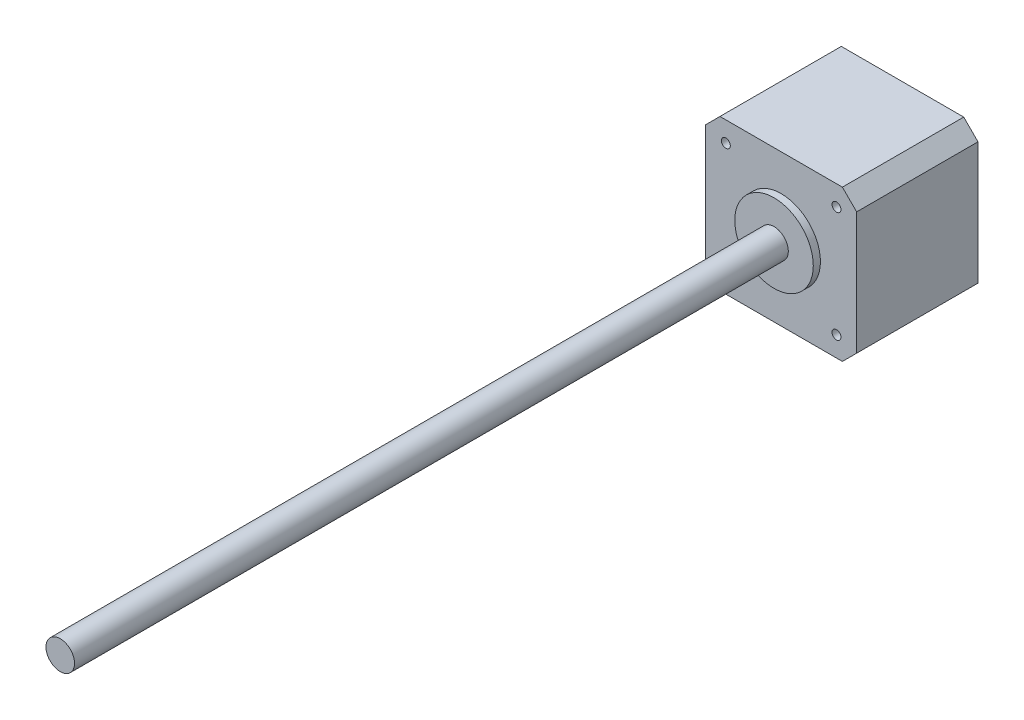
ISO-10303-21;
HEADER;
FILE_DESCRIPTION(('STEP AP214'),'2;1');
FILE_NAME('part.step','',(''),(''),'','','');
FILE_SCHEMA(('AUTOMOTIVE_DESIGN { 1 0 10303 214 1 1 1 1 }'));
ENDSEC;
DATA;
#1=APPLICATION_CONTEXT('core data for automotive mechanical design processes');
#2=APPLICATION_PROTOCOL_DEFINITION('international standard','automotive_design',2000,#1);
#3=PRODUCT_CONTEXT('',#1,'mechanical');
#4=PRODUCT('Part','Part','',(#3));
#5=PRODUCT_RELATED_PRODUCT_CATEGORY('part','',(#4));
#6=PRODUCT_DEFINITION_FORMATION('','',#4);
#7=PRODUCT_DEFINITION_CONTEXT('part definition',#1,'design');
#8=PRODUCT_DEFINITION('design','',#6,#7);
#9=PRODUCT_DEFINITION_SHAPE('','',#8);
#10=(LENGTH_UNIT() NAMED_UNIT(*) SI_UNIT(.MILLI.,.METRE.));
#11=(NAMED_UNIT(*) PLANE_ANGLE_UNIT() SI_UNIT($,.RADIAN.));
#12=(NAMED_UNIT(*) SI_UNIT($,.STERADIAN.) SOLID_ANGLE_UNIT());
#13=UNCERTAINTY_MEASURE_WITH_UNIT(LENGTH_MEASURE(1.E-05),#10,'distance_accuracy_value','');
#14=(GEOMETRIC_REPRESENTATION_CONTEXT(3) GLOBAL_UNCERTAINTY_ASSIGNED_CONTEXT((#13)) GLOBAL_UNIT_ASSIGNED_CONTEXT((#10,
#11,#12)) REPRESENTATION_CONTEXT('',''));
#15=CARTESIAN_POINT('',(0.,0.,0.));
#16=DIRECTION('',(0.,0.,1.));
#17=DIRECTION('',(1.,0.,0.));
#18=AXIS2_PLACEMENT_3D('',#15,#16,#17);
#19=CARTESIAN_POINT('',(21.15,21.15,34.));
#20=DIRECTION('',(-1.,0.,0.));
#21=DIRECTION('',(0.,0.,1.));
#22=AXIS2_PLACEMENT_3D('',#19,#20,#21);
#23=PLANE('',#22);
#24=DIRECTION('',(0.,1.,0.));
#25=VECTOR('',#24,1.);
#26=CARTESIAN_POINT('',(21.15,21.15,34.));
#27=LINE('',#26,#25);
#28=CARTESIAN_POINT('',(21.15,-17.15,34.));
#29=VERTEX_POINT('',#28);
#30=CARTESIAN_POINT('',(21.15,17.1499999999999,34.));
#31=VERTEX_POINT('',#30);
#32=EDGE_CURVE('E125',#29,#31,#27,.T.);
#33=ORIENTED_EDGE('',*,*,#32,.F.);
#34=DIRECTION('',(0.,0.,-1.));
#35=VECTOR('',#34,1.);
#36=CARTESIAN_POINT('',(21.15,-17.15,34.));
#37=LINE('',#36,#35);
#38=CARTESIAN_POINT('',(21.15,-17.15,0.));
#39=VERTEX_POINT('',#38);
#40=EDGE_CURVE('E151',#29,#39,#37,.T.);
#41=ORIENTED_EDGE('',*,*,#40,.T.);
#42=DIRECTION('',(0.,1.,0.));
#43=VECTOR('',#42,1.);
#44=CARTESIAN_POINT('',(21.15,21.15,0.));
#45=LINE('',#44,#43);
#46=CARTESIAN_POINT('',(21.15,17.1499999999999,0.));
#47=VERTEX_POINT('',#46);
#48=EDGE_CURVE('E159',#39,#47,#45,.T.);
#49=ORIENTED_EDGE('',*,*,#48,.T.);
#50=DIRECTION('',(0.,0.,1.));
#51=VECTOR('',#50,1.);
#52=CARTESIAN_POINT('',(21.15,17.1499999999999,34.));
#53=LINE('',#52,#51);
#54=EDGE_CURVE('E149',#47,#31,#53,.T.);
#55=ORIENTED_EDGE('',*,*,#54,.T.);
#56=EDGE_LOOP('',(#33,#41,#49,#55));
#57=FACE_BOUND('',#56,.T.);
#58=ADVANCED_FACE('F34',(#57),#23,.F.);
#59=CARTESIAN_POINT('',(-21.15,21.15,34.));
#60=DIRECTION('',(0.,-1.,0.));
#61=DIRECTION('',(0.,0.,-1.));
#62=AXIS2_PLACEMENT_3D('',#59,#60,#61);
#63=PLANE('',#62);
#64=DIRECTION('',(-1.,0.,0.));
#65=VECTOR('',#64,1.);
#66=CARTESIAN_POINT('',(-21.15,21.15,0.));
#67=LINE('',#66,#65);
#68=CARTESIAN_POINT('',(17.15,21.15,0.));
#69=VERTEX_POINT('',#68);
#70=CARTESIAN_POINT('',(-17.1499999999999,21.15,0.));
#71=VERTEX_POINT('',#70);
#72=EDGE_CURVE('E130',#69,#71,#67,.T.);
#73=ORIENTED_EDGE('',*,*,#72,.T.);
#74=DIRECTION('',(0.,0.,1.));
#75=VECTOR('',#74,1.);
#76=CARTESIAN_POINT('',(-17.1499999999999,21.15,34.));
#77=LINE('',#76,#75);
#78=CARTESIAN_POINT('',(-17.1499999999999,21.15,34.));
#79=VERTEX_POINT('',#78);
#80=EDGE_CURVE('E11',#71,#79,#77,.T.);
#81=ORIENTED_EDGE('',*,*,#80,.T.);
#82=DIRECTION('',(-1.,0.,0.));
#83=VECTOR('',#82,1.);
#84=CARTESIAN_POINT('',(-21.15,21.15,34.));
#85=LINE('',#84,#83);
#86=CARTESIAN_POINT('',(17.15,21.15,34.));
#87=VERTEX_POINT('',#86);
#88=EDGE_CURVE('E128',#87,#79,#85,.T.);
#89=ORIENTED_EDGE('',*,*,#88,.F.);
#90=DIRECTION('',(0.,0.,-1.));
#91=VECTOR('',#90,1.);
#92=CARTESIAN_POINT('',(17.15,21.15,34.));
#93=LINE('',#92,#91);
#94=EDGE_CURVE('E42',#87,#69,#93,.T.);
#95=ORIENTED_EDGE('',*,*,#94,.T.);
#96=EDGE_LOOP('',(#73,#81,#89,#95));
#97=FACE_BOUND('',#96,.T.);
#98=ADVANCED_FACE('F156',(#97),#63,.F.);
#99=CARTESIAN_POINT('',(-21.15,21.15,34.));
#100=DIRECTION('',(1.,0.,0.));
#101=DIRECTION('',(0.,1.,0.));
#102=AXIS2_PLACEMENT_3D('',#99,#100,#101);
#103=PLANE('',#102);
#104=DIRECTION('',(0.,-1.,0.));
#105=VECTOR('',#104,1.);
#106=CARTESIAN_POINT('',(-21.15,21.15,0.));
#107=LINE('',#106,#105);
#108=CARTESIAN_POINT('',(-21.15,17.15,0.));
#109=VERTEX_POINT('',#108);
#110=CARTESIAN_POINT('',(-21.15,-17.15,0.));
#111=VERTEX_POINT('',#110);
#112=EDGE_CURVE('E126',#109,#111,#107,.T.);
#113=ORIENTED_EDGE('',*,*,#112,.T.);
#114=DIRECTION('',(0.,0.,1.));
#115=VECTOR('',#114,1.);
#116=CARTESIAN_POINT('',(-21.15,-17.15,34.));
#117=LINE('',#116,#115);
#118=CARTESIAN_POINT('',(-21.15,-17.15,34.));
#119=VERTEX_POINT('',#118);
#120=EDGE_CURVE('E104',#111,#119,#117,.T.);
#121=ORIENTED_EDGE('',*,*,#120,.T.);
#122=DIRECTION('',(0.,-1.,0.));
#123=VECTOR('',#122,1.);
#124=CARTESIAN_POINT('',(-21.15,21.15,34.));
#125=LINE('',#124,#123);
#126=CARTESIAN_POINT('',(-21.15,17.15,34.));
#127=VERTEX_POINT('',#126);
#128=EDGE_CURVE('E164',#127,#119,#125,.T.);
#129=ORIENTED_EDGE('',*,*,#128,.F.);
#130=DIRECTION('',(0.,0.,-1.));
#131=VECTOR('',#130,1.);
#132=CARTESIAN_POINT('',(-21.15,17.15,34.));
#133=LINE('',#132,#131);
#134=EDGE_CURVE('E109',#127,#109,#133,.T.);
#135=ORIENTED_EDGE('',*,*,#134,.T.);
#136=EDGE_LOOP('',(#113,#121,#129,#135));
#137=FACE_BOUND('',#136,.T.);
#138=ADVANCED_FACE('F228',(#137),#103,.F.);
#139=CARTESIAN_POINT('',(-21.15,-21.15,34.));
#140=DIRECTION('',(0.,1.,0.));
#141=DIRECTION('',(0.,0.,1.));
#142=AXIS2_PLACEMENT_3D('',#139,#140,#141);
#143=PLANE('',#142);
#144=DIRECTION('',(1.,0.,0.));
#145=VECTOR('',#144,1.);
#146=CARTESIAN_POINT('',(-21.15,-21.15,34.));
#147=LINE('',#146,#145);
#148=CARTESIAN_POINT('',(-17.15,-21.15,34.));
#149=VERTEX_POINT('',#148);
#150=CARTESIAN_POINT('',(17.1499999999999,-21.15,34.));
#151=VERTEX_POINT('',#150);
#152=EDGE_CURVE('E119',#149,#151,#147,.T.);
#153=ORIENTED_EDGE('',*,*,#152,.F.);
#154=DIRECTION('',(0.,0.,-1.));
#155=VECTOR('',#154,1.);
#156=CARTESIAN_POINT('',(-17.15,-21.15,34.));
#157=LINE('',#156,#155);
#158=CARTESIAN_POINT('',(-17.15,-21.15,0.));
#159=VERTEX_POINT('',#158);
#160=EDGE_CURVE('E103',#149,#159,#157,.T.);
#161=ORIENTED_EDGE('',*,*,#160,.T.);
#162=DIRECTION('',(1.,0.,0.));
#163=VECTOR('',#162,1.);
#164=CARTESIAN_POINT('',(-21.15,-21.15,0.));
#165=LINE('',#164,#163);
#166=CARTESIAN_POINT('',(17.1499999999999,-21.15,0.));
#167=VERTEX_POINT('',#166);
#168=EDGE_CURVE('E116',#159,#167,#165,.T.);
#169=ORIENTED_EDGE('',*,*,#168,.T.);
#170=DIRECTION('',(0.,0.,1.));
#171=VECTOR('',#170,1.);
#172=CARTESIAN_POINT('',(17.1499999999999,-21.15,34.));
#173=LINE('',#172,#171);
#174=EDGE_CURVE('E121',#167,#151,#173,.T.);
#175=ORIENTED_EDGE('',*,*,#174,.T.);
#176=EDGE_LOOP('',(#153,#161,#169,#175));
#177=FACE_BOUND('',#176,.T.);
#178=ADVANCED_FACE('F115',(#177),#143,.F.);
#179=CARTESIAN_POINT('',(0.,0.,34.));
#180=DIRECTION('',(0.,0.,1.));
#181=DIRECTION('',(1.,0.,0.));
#182=AXIS2_PLACEMENT_3D('',#179,#180,#181);
#183=PLANE('',#182);
#184=CARTESIAN_POINT('',(-15.5,-15.5,34.));
#185=DIRECTION('',(0.,0.,1.));
#186=DIRECTION('',(1.,0.,0.));
#187=AXIS2_PLACEMENT_3D('',#184,#185,#186);
#188=CIRCLE('',#187,1.25);
#189=CARTESIAN_POINT('',(-14.25,-15.5,34.));
#190=VERTEX_POINT('',#189);
#191=EDGE_CURVE('E198',#190,#190,#188,.T.);
#192=ORIENTED_EDGE('',*,*,#191,.F.);
#193=EDGE_LOOP('',(#192));
#194=FACE_BOUND('',#193,.T.);
#195=CARTESIAN_POINT('',(15.5,-15.5,34.));
#196=DIRECTION('',(0.,0.,1.));
#197=DIRECTION('',(1.,0.,0.));
#198=AXIS2_PLACEMENT_3D('',#195,#196,#197);
#199=CIRCLE('',#198,1.25);
#200=CARTESIAN_POINT('',(16.75,-15.5,34.));
#201=VERTEX_POINT('',#200);
#202=EDGE_CURVE('E192',#201,#201,#199,.T.);
#203=ORIENTED_EDGE('',*,*,#202,.F.);
#204=EDGE_LOOP('',(#203));
#205=FACE_BOUND('',#204,.T.);
#206=CARTESIAN_POINT('',(15.5,15.5,34.));
#207=DIRECTION('',(0.,0.,1.));
#208=DIRECTION('',(1.,0.,0.));
#209=AXIS2_PLACEMENT_3D('',#206,#207,#208);
#210=CIRCLE('',#209,1.25);
#211=CARTESIAN_POINT('',(16.75,15.5,34.));
#212=VERTEX_POINT('',#211);
#213=EDGE_CURVE('E186',#212,#212,#210,.T.);
#214=ORIENTED_EDGE('',*,*,#213,.F.);
#215=EDGE_LOOP('',(#214));
#216=FACE_BOUND('',#215,.T.);
#217=CARTESIAN_POINT('',(-15.5,15.5,34.));
#218=DIRECTION('',(0.,0.,1.));
#219=DIRECTION('',(1.,0.,0.));
#220=AXIS2_PLACEMENT_3D('',#217,#218,#219);
#221=CIRCLE('',#220,1.25);
#222=CARTESIAN_POINT('',(-14.25,15.5,34.));
#223=VERTEX_POINT('',#222);
#224=EDGE_CURVE('E180',#223,#223,#221,.T.);
#225=ORIENTED_EDGE('',*,*,#224,.F.);
#226=EDGE_LOOP('',(#225));
#227=FACE_BOUND('',#226,.T.);
#228=CARTESIAN_POINT('',(0.,0.,34.));
#229=DIRECTION('',(0.,0.,1.));
#230=DIRECTION('',(1.,0.,0.));
#231=AXIS2_PLACEMENT_3D('',#228,#229,#230);
#232=CIRCLE('',#231,11.);
#233=CARTESIAN_POINT('',(11.,0.,34.));
#234=VERTEX_POINT('',#233);
#235=EDGE_CURVE('E168',#234,#234,#232,.T.);
#236=ORIENTED_EDGE('',*,*,#235,.F.);
#237=EDGE_LOOP('',(#236));
#238=FACE_BOUND('',#237,.T.);
#239=ORIENTED_EDGE('',*,*,#128,.T.);
#240=DIRECTION('',(-0.707106781186548,0.707106781186548,0.));
#241=VECTOR('',#240,1.);
#242=CARTESIAN_POINT('',(-19.15,-19.15,34.));
#243=LINE('',#242,#241);
#244=EDGE_CURVE('E147',#119,#149,#243,.F.);
#245=ORIENTED_EDGE('',*,*,#244,.T.);
#246=ORIENTED_EDGE('',*,*,#152,.T.);
#247=DIRECTION('',(-0.70710678118655,-0.707106781186545,0.));
#248=VECTOR('',#247,1.);
#249=CARTESIAN_POINT('',(19.1499999999999,-19.15,34.));
#250=LINE('',#249,#248);
#251=EDGE_CURVE('E145',#151,#29,#250,.F.);
#252=ORIENTED_EDGE('',*,*,#251,.T.);
#253=ORIENTED_EDGE('',*,*,#32,.T.);
#254=DIRECTION('',(0.707106781186545,-0.70710678118655,0.));
#255=VECTOR('',#254,1.);
#256=CARTESIAN_POINT('',(19.15,19.1499999999999,34.));
#257=LINE('',#256,#255);
#258=EDGE_CURVE('E54',#31,#87,#257,.F.);
#259=ORIENTED_EDGE('',*,*,#258,.T.);
#260=ORIENTED_EDGE('',*,*,#88,.T.);
#261=DIRECTION('',(0.70710678118655,0.707106781186545,0.));
#262=VECTOR('',#261,1.);
#263=CARTESIAN_POINT('',(-19.1499999999999,19.15,34.));
#264=LINE('',#263,#262);
#265=EDGE_CURVE('E143',#79,#127,#264,.F.);
#266=ORIENTED_EDGE('',*,*,#265,.T.);
#267=EDGE_LOOP('',(#239,#245,#246,#252,#253,#259,#260,#266));
#268=FACE_BOUND('',#267,.T.);
#269=ADVANCED_FACE('F213',(#194,#205,#216,#227,#238,#268),#183,.T.);
#270=CARTESIAN_POINT('',(0.,0.,0.));
#271=DIRECTION('',(0.,0.,1.));
#272=DIRECTION('',(1.,0.,0.));
#273=AXIS2_PLACEMENT_3D('',#270,#271,#272);
#274=PLANE('',#273);
#275=ORIENTED_EDGE('',*,*,#168,.F.);
#276=DIRECTION('',(0.707106781186548,-0.707106781186548,0.));
#277=VECTOR('',#276,1.);
#278=CARTESIAN_POINT('',(-17.15,-21.15,0.));
#279=LINE('',#278,#277);
#280=EDGE_CURVE('E99',#159,#111,#279,.F.);
#281=ORIENTED_EDGE('',*,*,#280,.T.);
#282=ORIENTED_EDGE('',*,*,#112,.F.);
#283=DIRECTION('',(-0.70710678118655,-0.707106781186545,0.));
#284=VECTOR('',#283,1.);
#285=CARTESIAN_POINT('',(-21.15,17.15,0.));
#286=LINE('',#285,#284);
#287=EDGE_CURVE('E136',#109,#71,#286,.F.);
#288=ORIENTED_EDGE('',*,*,#287,.T.);
#289=ORIENTED_EDGE('',*,*,#72,.F.);
#290=DIRECTION('',(-0.707106781186545,0.70710678118655,0.));
#291=VECTOR('',#290,1.);
#292=CARTESIAN_POINT('',(17.15,21.15,0.));
#293=LINE('',#292,#291);
#294=EDGE_CURVE('E120',#69,#47,#293,.F.);
#295=ORIENTED_EDGE('',*,*,#294,.T.);
#296=ORIENTED_EDGE('',*,*,#48,.F.);
#297=DIRECTION('',(0.70710678118655,0.707106781186545,0.));
#298=VECTOR('',#297,1.);
#299=CARTESIAN_POINT('',(21.15,-17.15,0.));
#300=LINE('',#299,#298);
#301=EDGE_CURVE('E110',#39,#167,#300,.F.);
#302=ORIENTED_EDGE('',*,*,#301,.T.);
#303=EDGE_LOOP('',(#275,#281,#282,#288,#289,#295,#296,#302));
#304=FACE_BOUND('',#303,.T.);
#305=ADVANCED_FACE('F123',(#304),#274,.F.);
#306=CARTESIAN_POINT('',(0.,0.,36.));
#307=DIRECTION('',(0.,0.,-1.));
#308=DIRECTION('',(-1.,0.,0.));
#309=AXIS2_PLACEMENT_3D('',#306,#307,#308);
#310=CYLINDRICAL_SURFACE('',#309,11.);
#311=CARTESIAN_POINT('',(0.,0.,36.));
#312=DIRECTION('',(0.,0.,1.));
#313=DIRECTION('',(1.,0.,0.));
#314=AXIS2_PLACEMENT_3D('',#311,#312,#313);
#315=CIRCLE('',#314,11.);
#316=CARTESIAN_POINT('',(11.,0.,36.));
#317=VERTEX_POINT('',#316);
#318=EDGE_CURVE('E160',#317,#317,#315,.T.);
#319=ORIENTED_EDGE('',*,*,#318,.F.);
#320=EDGE_LOOP('',(#319));
#321=FACE_BOUND('',#320,.T.);
#322=ORIENTED_EDGE('',*,*,#235,.T.);
#323=EDGE_LOOP('',(#322));
#324=FACE_BOUND('',#323,.T.);
#325=ADVANCED_FACE('F269',(#321,#324),#310,.T.);
#326=CARTESIAN_POINT('',(0.,0.,36.));
#327=DIRECTION('',(0.,0.,1.));
#328=DIRECTION('',(1.,0.,0.));
#329=AXIS2_PLACEMENT_3D('',#326,#327,#328);
#330=PLANE('',#329);
#331=CARTESIAN_POINT('',(0.,0.,36.));
#332=DIRECTION('',(0.,0.,1.));
#333=DIRECTION('',(1.,0.,0.));
#334=AXIS2_PLACEMENT_3D('',#331,#332,#333);
#335=CIRCLE('',#334,4.);
#336=CARTESIAN_POINT('',(4.,0.,36.));
#337=VERTEX_POINT('',#336);
#338=EDGE_CURVE('E174',#337,#337,#335,.T.);
#339=ORIENTED_EDGE('',*,*,#338,.F.);
#340=EDGE_LOOP('',(#339));
#341=FACE_BOUND('',#340,.T.);
#342=ORIENTED_EDGE('',*,*,#318,.T.);
#343=EDGE_LOOP('',(#342));
#344=FACE_BOUND('',#343,.T.);
#345=ADVANCED_FACE('F261',(#341,#344),#330,.T.);
#346=CARTESIAN_POINT('',(0.,0.,236.));
#347=DIRECTION('',(0.,0.,-1.));
#348=DIRECTION('',(-1.,0.,0.));
#349=AXIS2_PLACEMENT_3D('',#346,#347,#348);
#350=CYLINDRICAL_SURFACE('',#349,4.);
#351=CARTESIAN_POINT('',(0.,0.,236.));
#352=DIRECTION('',(0.,0.,1.));
#353=DIRECTION('',(1.,0.,0.));
#354=AXIS2_PLACEMENT_3D('',#351,#352,#353);
#355=CIRCLE('',#354,4.);
#356=CARTESIAN_POINT('',(4.,0.,236.));
#357=VERTEX_POINT('',#356);
#358=EDGE_CURVE('E171',#357,#357,#355,.T.);
#359=ORIENTED_EDGE('',*,*,#358,.F.);
#360=EDGE_LOOP('',(#359));
#361=FACE_BOUND('',#360,.T.);
#362=ORIENTED_EDGE('',*,*,#338,.T.);
#363=EDGE_LOOP('',(#362));
#364=FACE_BOUND('',#363,.T.);
#365=ADVANCED_FACE('F255',(#361,#364),#350,.T.);
#366=CARTESIAN_POINT('',(0.,0.,236.));
#367=DIRECTION('',(0.,0.,1.));
#368=DIRECTION('',(1.,0.,0.));
#369=AXIS2_PLACEMENT_3D('',#366,#367,#368);
#370=PLANE('',#369);
#371=ORIENTED_EDGE('',*,*,#358,.T.);
#372=EDGE_LOOP('',(#371));
#373=FACE_BOUND('',#372,.T.);
#374=ADVANCED_FACE('F251',(#373),#370,.T.);
#375=CARTESIAN_POINT('',(-17.15,-21.15,34.));
#376=DIRECTION('',(0.707106781186547,0.707106781186547,0.));
#377=DIRECTION('',(0.,0.,-1.));
#378=AXIS2_PLACEMENT_3D('',#375,#376,#377);
#379=PLANE('',#378);
#380=ORIENTED_EDGE('',*,*,#244,.F.);
#381=ORIENTED_EDGE('',*,*,#120,.F.);
#382=ORIENTED_EDGE('',*,*,#280,.F.);
#383=ORIENTED_EDGE('',*,*,#160,.F.);
#384=EDGE_LOOP('',(#380,#381,#382,#383));
#385=FACE_BOUND('',#384,.T.);
#386=ADVANCED_FACE('F102',(#385),#379,.F.);
#387=CARTESIAN_POINT('',(21.15,-17.15,34.));
#388=DIRECTION('',(-0.707106781186545,0.70710678118655,0.));
#389=DIRECTION('',(0.,0.,-1.));
#390=AXIS2_PLACEMENT_3D('',#387,#388,#389);
#391=PLANE('',#390);
#392=ORIENTED_EDGE('',*,*,#251,.F.);
#393=ORIENTED_EDGE('',*,*,#174,.F.);
#394=ORIENTED_EDGE('',*,*,#301,.F.);
#395=ORIENTED_EDGE('',*,*,#40,.F.);
#396=EDGE_LOOP('',(#392,#393,#394,#395));
#397=FACE_BOUND('',#396,.T.);
#398=ADVANCED_FACE('F232',(#397),#391,.F.);
#399=CARTESIAN_POINT('',(-21.15,17.15,34.));
#400=DIRECTION('',(0.707106781186545,-0.70710678118655,0.));
#401=DIRECTION('',(0.,0.,-1.));
#402=AXIS2_PLACEMENT_3D('',#399,#400,#401);
#403=PLANE('',#402);
#404=ORIENTED_EDGE('',*,*,#265,.F.);
#405=ORIENTED_EDGE('',*,*,#80,.F.);
#406=ORIENTED_EDGE('',*,*,#287,.F.);
#407=ORIENTED_EDGE('',*,*,#134,.F.);
#408=EDGE_LOOP('',(#404,#405,#406,#407));
#409=FACE_BOUND('',#408,.T.);
#410=ADVANCED_FACE('F230',(#409),#403,.F.);
#411=CARTESIAN_POINT('',(17.15,21.15,34.));
#412=DIRECTION('',(-0.70710678118655,-0.707106781186545,0.));
#413=DIRECTION('',(0.,0.,-1.));
#414=AXIS2_PLACEMENT_3D('',#411,#412,#413);
#415=PLANE('',#414);
#416=ORIENTED_EDGE('',*,*,#258,.F.);
#417=ORIENTED_EDGE('',*,*,#54,.F.);
#418=ORIENTED_EDGE('',*,*,#294,.F.);
#419=ORIENTED_EDGE('',*,*,#94,.F.);
#420=EDGE_LOOP('',(#416,#417,#418,#419));
#421=FACE_BOUND('',#420,.T.);
#422=ADVANCED_FACE('F36',(#421),#415,.F.);
#423=CARTESIAN_POINT('',(-15.5,15.5,24.));
#424=DIRECTION('',(0.,0.,1.));
#425=DIRECTION('',(1.,0.,0.));
#426=AXIS2_PLACEMENT_3D('',#423,#424,#425);
#427=CYLINDRICAL_SURFACE('',#426,1.25);
#428=CARTESIAN_POINT('',(-15.5,15.5,24.));
#429=DIRECTION('',(0.,0.,1.));
#430=DIRECTION('',(1.,0.,0.));
#431=AXIS2_PLACEMENT_3D('',#428,#429,#430);
#432=CIRCLE('',#431,1.25);
#433=CARTESIAN_POINT('',(-14.25,15.5,24.));
#434=VERTEX_POINT('',#433);
#435=EDGE_CURVE('E177',#434,#434,#432,.T.);
#436=ORIENTED_EDGE('',*,*,#435,.F.);
#437=EDGE_LOOP('',(#436));
#438=FACE_BOUND('',#437,.T.);
#439=ORIENTED_EDGE('',*,*,#224,.T.);
#440=EDGE_LOOP('',(#439));
#441=FACE_BOUND('',#440,.T.);
#442=ADVANCED_FACE('F237',(#438,#441),#427,.F.);
#443=CARTESIAN_POINT('',(-15.5,15.5,24.));
#444=DIRECTION('',(0.,0.,1.));
#445=DIRECTION('',(1.,0.,0.));
#446=AXIS2_PLACEMENT_3D('',#443,#444,#445);
#447=PLANE('',#446);
#448=ORIENTED_EDGE('',*,*,#435,.T.);
#449=EDGE_LOOP('',(#448));
#450=FACE_BOUND('',#449,.T.);
#451=ADVANCED_FACE('F347',(#450),#447,.T.);
#452=CARTESIAN_POINT('',(15.5,15.5,24.));
#453=DIRECTION('',(0.,0.,1.));
#454=DIRECTION('',(1.,0.,0.));
#455=AXIS2_PLACEMENT_3D('',#452,#453,#454);
#456=CYLINDRICAL_SURFACE('',#455,1.25);
#457=CARTESIAN_POINT('',(15.5,15.5,24.));
#458=DIRECTION('',(0.,0.,1.));
#459=DIRECTION('',(1.,0.,0.));
#460=AXIS2_PLACEMENT_3D('',#457,#458,#459);
#461=CIRCLE('',#460,1.25);
#462=CARTESIAN_POINT('',(16.75,15.5,24.));
#463=VERTEX_POINT('',#462);
#464=EDGE_CURVE('E183',#463,#463,#461,.T.);
#465=ORIENTED_EDGE('',*,*,#464,.F.);
#466=EDGE_LOOP('',(#465));
#467=FACE_BOUND('',#466,.T.);
#468=ORIENTED_EDGE('',*,*,#213,.T.);
#469=EDGE_LOOP('',(#468));
#470=FACE_BOUND('',#469,.T.);
#471=ADVANCED_FACE('F356',(#467,#470),#456,.F.);
#472=CARTESIAN_POINT('',(15.5,15.5,24.));
#473=DIRECTION('',(0.,0.,1.));
#474=DIRECTION('',(1.,0.,0.));
#475=AXIS2_PLACEMENT_3D('',#472,#473,#474);
#476=PLANE('',#475);
#477=ORIENTED_EDGE('',*,*,#464,.T.);
#478=EDGE_LOOP('',(#477));
#479=FACE_BOUND('',#478,.T.);
#480=ADVANCED_FACE('F365',(#479),#476,.T.);
#481=CARTESIAN_POINT('',(15.5,-15.5,24.));
#482=DIRECTION('',(0.,0.,1.));
#483=DIRECTION('',(1.,0.,0.));
#484=AXIS2_PLACEMENT_3D('',#481,#482,#483);
#485=CYLINDRICAL_SURFACE('',#484,1.25);
#486=CARTESIAN_POINT('',(15.5,-15.5,24.));
#487=DIRECTION('',(0.,0.,1.));
#488=DIRECTION('',(1.,0.,0.));
#489=AXIS2_PLACEMENT_3D('',#486,#487,#488);
#490=CIRCLE('',#489,1.25);
#491=CARTESIAN_POINT('',(16.75,-15.5,24.));
#492=VERTEX_POINT('',#491);
#493=EDGE_CURVE('E189',#492,#492,#490,.T.);
#494=ORIENTED_EDGE('',*,*,#493,.F.);
#495=EDGE_LOOP('',(#494));
#496=FACE_BOUND('',#495,.T.);
#497=ORIENTED_EDGE('',*,*,#202,.T.);
#498=EDGE_LOOP('',(#497));
#499=FACE_BOUND('',#498,.T.);
#500=ADVANCED_FACE('F375',(#496,#499),#485,.F.);
#501=CARTESIAN_POINT('',(15.5,-15.5,24.));
#502=DIRECTION('',(0.,0.,1.));
#503=DIRECTION('',(1.,0.,0.));
#504=AXIS2_PLACEMENT_3D('',#501,#502,#503);
#505=PLANE('',#504);
#506=ORIENTED_EDGE('',*,*,#493,.T.);
#507=EDGE_LOOP('',(#506));
#508=FACE_BOUND('',#507,.T.);
#509=ADVANCED_FACE('F209',(#508),#505,.T.);
#510=CARTESIAN_POINT('',(-15.5,-15.5,24.));
#511=DIRECTION('',(0.,0.,1.));
#512=DIRECTION('',(1.,0.,0.));
#513=AXIS2_PLACEMENT_3D('',#510,#511,#512);
#514=CYLINDRICAL_SURFACE('',#513,1.25);
#515=CARTESIAN_POINT('',(-15.5,-15.5,24.));
#516=DIRECTION('',(0.,0.,1.));
#517=DIRECTION('',(1.,0.,0.));
#518=AXIS2_PLACEMENT_3D('',#515,#516,#517);
#519=CIRCLE('',#518,1.25);
#520=CARTESIAN_POINT('',(-14.25,-15.5,24.));
#521=VERTEX_POINT('',#520);
#522=EDGE_CURVE('E195',#521,#521,#519,.T.);
#523=ORIENTED_EDGE('',*,*,#522,.F.);
#524=EDGE_LOOP('',(#523));
#525=FACE_BOUND('',#524,.T.);
#526=ORIENTED_EDGE('',*,*,#191,.T.);
#527=EDGE_LOOP('',(#526));
#528=FACE_BOUND('',#527,.T.);
#529=ADVANCED_FACE('F206',(#525,#528),#514,.F.);
#530=CARTESIAN_POINT('',(-15.5,-15.5,24.));
#531=DIRECTION('',(0.,0.,1.));
#532=DIRECTION('',(1.,0.,0.));
#533=AXIS2_PLACEMENT_3D('',#530,#531,#532);
#534=PLANE('',#533);
#535=ORIENTED_EDGE('',*,*,#522,.T.);
#536=EDGE_LOOP('',(#535));
#537=FACE_BOUND('',#536,.T.);
#538=ADVANCED_FACE('F204',(#537),#534,.T.);
#539=CLOSED_SHELL('',(#58,#98,#138,#178,#269,#305,#325,#345,#365,#374,#386,#398,#410,#422,#442,
#451,#471,#480,#500,#509,#529,#538));
#540=MANIFOLD_SOLID_BREP('B2',#539);
#541=ADVANCED_BREP_SHAPE_REPRESENTATION('',(#18,#540),#14);
#542=SHAPE_DEFINITION_REPRESENTATION(#9,#541);
ENDSEC;
END-ISO-10303-21;
